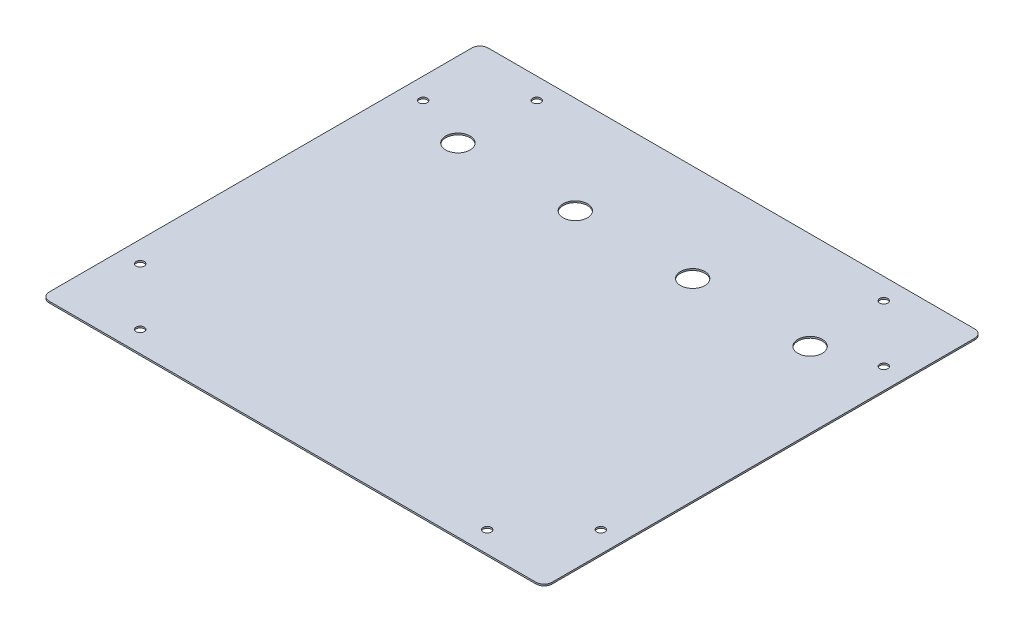
ISO-10303-21;
HEADER;
FILE_DESCRIPTION(('STEP AP214'),'2;1');
FILE_NAME('part.step','',(''),(''),'','','');
FILE_SCHEMA(('AUTOMOTIVE_DESIGN { 1 0 10303 214 1 1 1 1 }'));
ENDSEC;
DATA;
#1=APPLICATION_CONTEXT('core data for automotive mechanical design processes');
#2=APPLICATION_PROTOCOL_DEFINITION('international standard','automotive_design',2000,#1);
#3=PRODUCT_CONTEXT('',#1,'mechanical');
#4=PRODUCT('Part','Part','',(#3));
#5=PRODUCT_RELATED_PRODUCT_CATEGORY('part','',(#4));
#6=PRODUCT_DEFINITION_FORMATION('','',#4);
#7=PRODUCT_DEFINITION_CONTEXT('part definition',#1,'design');
#8=PRODUCT_DEFINITION('design','',#6,#7);
#9=PRODUCT_DEFINITION_SHAPE('','',#8);
#10=(LENGTH_UNIT() NAMED_UNIT(*) SI_UNIT(.MILLI.,.METRE.));
#11=(NAMED_UNIT(*) PLANE_ANGLE_UNIT() SI_UNIT($,.RADIAN.));
#12=(NAMED_UNIT(*) SI_UNIT($,.STERADIAN.) SOLID_ANGLE_UNIT());
#13=UNCERTAINTY_MEASURE_WITH_UNIT(LENGTH_MEASURE(1.E-05),#10,'distance_accuracy_value','');
#14=(GEOMETRIC_REPRESENTATION_CONTEXT(3) GLOBAL_UNCERTAINTY_ASSIGNED_CONTEXT((#13)) GLOBAL_UNIT_ASSIGNED_CONTEXT((#10,
#11,#12)) REPRESENTATION_CONTEXT('',''));
#15=CARTESIAN_POINT('',(0.,0.,0.));
#16=DIRECTION('',(0.,0.,1.));
#17=DIRECTION('',(1.,0.,0.));
#18=AXIS2_PLACEMENT_3D('',#15,#16,#17);
#19=CARTESIAN_POINT('',(-154.9,-1.,135.17));
#20=DIRECTION('',(-1.,0.,0.));
#21=DIRECTION('',(0.,0.,1.));
#22=AXIS2_PLACEMENT_3D('',#19,#20,#21);
#23=PLANE('',#22);
#24=DIRECTION('',(0.,0.,1.));
#25=VECTOR('',#24,1.);
#26=CARTESIAN_POINT('',(-154.9,-1.,135.17));
#27=LINE('',#26,#25);
#28=CARTESIAN_POINT('',(-154.9,-1.,-130.17));
#29=VERTEX_POINT('',#28);
#30=CARTESIAN_POINT('',(-154.9,-1.,130.17));
#31=VERTEX_POINT('',#30);
#32=EDGE_CURVE('E227',#29,#31,#27,.T.);
#33=ORIENTED_EDGE('',*,*,#32,.T.);
#34=DIRECTION('',(0.,1.,0.));
#35=VECTOR('',#34,1.);
#36=CARTESIAN_POINT('',(-154.9,-1.,130.17));
#37=LINE('',#36,#35);
#38=CARTESIAN_POINT('',(-154.9,0.,130.17));
#39=VERTEX_POINT('',#38);
#40=EDGE_CURVE('E125',#31,#39,#37,.T.);
#41=ORIENTED_EDGE('',*,*,#40,.T.);
#42=DIRECTION('',(0.,0.,1.));
#43=VECTOR('',#42,1.);
#44=CARTESIAN_POINT('',(-154.9,0.,135.17));
#45=LINE('',#44,#43);
#46=CARTESIAN_POINT('',(-154.9,0.,-130.17));
#47=VERTEX_POINT('',#46);
#48=EDGE_CURVE('E109',#47,#39,#45,.T.);
#49=ORIENTED_EDGE('',*,*,#48,.F.);
#50=DIRECTION('',(0.,1.,0.));
#51=VECTOR('',#50,1.);
#52=CARTESIAN_POINT('',(-154.9,-1.,-130.17));
#53=LINE('',#52,#51);
#54=EDGE_CURVE('E122',#47,#29,#53,.F.);
#55=ORIENTED_EDGE('',*,*,#54,.T.);
#56=EDGE_LOOP('',(#33,#41,#49,#55));
#57=FACE_BOUND('',#56,.T.);
#58=ADVANCED_FACE('F38',(#57),#23,.T.);
#59=CARTESIAN_POINT('',(154.9,-1.,-135.17));
#60=DIRECTION('',(0.,0.,-1.));
#61=DIRECTION('',(-1.,0.,0.));
#62=AXIS2_PLACEMENT_3D('',#59,#60,#61);
#63=PLANE('',#62);
#64=DIRECTION('',(-1.,0.,0.));
#65=VECTOR('',#64,1.);
#66=CARTESIAN_POINT('',(154.9,-1.,-135.17));
#67=LINE('',#66,#65);
#68=CARTESIAN_POINT('',(149.9,-1.,-135.17));
#69=VERTEX_POINT('',#68);
#70=CARTESIAN_POINT('',(-149.9,-1.,-135.17));
#71=VERTEX_POINT('',#70);
#72=EDGE_CURVE('E132',#69,#71,#67,.T.);
#73=ORIENTED_EDGE('',*,*,#72,.T.);
#74=DIRECTION('',(0.,1.,0.));
#75=VECTOR('',#74,1.);
#76=CARTESIAN_POINT('',(-149.9,-1.,-135.17));
#77=LINE('',#76,#75);
#78=CARTESIAN_POINT('',(-149.9,0.,-135.17));
#79=VERTEX_POINT('',#78);
#80=EDGE_CURVE('E158',#71,#79,#77,.T.);
#81=ORIENTED_EDGE('',*,*,#80,.T.);
#82=DIRECTION('',(-1.,0.,0.));
#83=VECTOR('',#82,1.);
#84=CARTESIAN_POINT('',(154.9,0.,-135.17));
#85=LINE('',#84,#83);
#86=CARTESIAN_POINT('',(149.9,0.,-135.17));
#87=VERTEX_POINT('',#86);
#88=EDGE_CURVE('E111',#87,#79,#85,.T.);
#89=ORIENTED_EDGE('',*,*,#88,.F.);
#90=DIRECTION('',(0.,1.,0.));
#91=VECTOR('',#90,1.);
#92=CARTESIAN_POINT('',(149.9,-1.,-135.17));
#93=LINE('',#92,#91);
#94=EDGE_CURVE('E156',#87,#69,#93,.F.);
#95=ORIENTED_EDGE('',*,*,#94,.T.);
#96=EDGE_LOOP('',(#73,#81,#89,#95));
#97=FACE_BOUND('',#96,.T.);
#98=ADVANCED_FACE('F251',(#97),#63,.T.);
#99=CARTESIAN_POINT('',(154.9,-1.,135.17));
#100=DIRECTION('',(1.,0.,0.));
#101=DIRECTION('',(0.,0.,-1.));
#102=AXIS2_PLACEMENT_3D('',#99,#100,#101);
#103=PLANE('',#102);
#104=DIRECTION('',(0.,0.,-1.));
#105=VECTOR('',#104,1.);
#106=CARTESIAN_POINT('',(154.9,-1.,135.17));
#107=LINE('',#106,#105);
#108=CARTESIAN_POINT('',(154.9,-1.,130.17));
#109=VERTEX_POINT('',#108);
#110=CARTESIAN_POINT('',(154.9,-1.,-130.17));
#111=VERTEX_POINT('',#110);
#112=EDGE_CURVE('E137',#109,#111,#107,.T.);
#113=ORIENTED_EDGE('',*,*,#112,.T.);
#114=DIRECTION('',(0.,1.,0.));
#115=VECTOR('',#114,1.);
#116=CARTESIAN_POINT('',(154.9,-1.,-130.17));
#117=LINE('',#116,#115);
#118=CARTESIAN_POINT('',(154.9,0.,-130.17));
#119=VERTEX_POINT('',#118);
#120=EDGE_CURVE('E11',#111,#119,#117,.T.);
#121=ORIENTED_EDGE('',*,*,#120,.T.);
#122=DIRECTION('',(0.,0.,-1.));
#123=VECTOR('',#122,1.);
#124=CARTESIAN_POINT('',(154.9,0.,135.17));
#125=LINE('',#124,#123);
#126=CARTESIAN_POINT('',(154.9,0.,130.17));
#127=VERTEX_POINT('',#126);
#128=EDGE_CURVE('E234',#127,#119,#125,.T.);
#129=ORIENTED_EDGE('',*,*,#128,.F.);
#130=DIRECTION('',(0.,1.,0.));
#131=VECTOR('',#130,1.);
#132=CARTESIAN_POINT('',(154.9,-1.,130.17));
#133=LINE('',#132,#131);
#134=EDGE_CURVE('E47',#127,#109,#133,.F.);
#135=ORIENTED_EDGE('',*,*,#134,.T.);
#136=EDGE_LOOP('',(#113,#121,#129,#135));
#137=FACE_BOUND('',#136,.T.);
#138=ADVANCED_FACE('F236',(#137),#103,.T.);
#139=CARTESIAN_POINT('',(154.9,-1.,135.17));
#140=DIRECTION('',(0.,0.,1.));
#141=DIRECTION('',(1.,0.,0.));
#142=AXIS2_PLACEMENT_3D('',#139,#140,#141);
#143=PLANE('',#142);
#144=DIRECTION('',(1.,0.,0.));
#145=VECTOR('',#144,1.);
#146=CARTESIAN_POINT('',(154.9,0.,135.17));
#147=LINE('',#146,#145);
#148=CARTESIAN_POINT('',(-149.9,0.,135.17));
#149=VERTEX_POINT('',#148);
#150=CARTESIAN_POINT('',(149.9,0.,135.17));
#151=VERTEX_POINT('',#150);
#152=EDGE_CURVE('E126',#149,#151,#147,.T.);
#153=ORIENTED_EDGE('',*,*,#152,.F.);
#154=DIRECTION('',(0.,1.,0.));
#155=VECTOR('',#154,1.);
#156=CARTESIAN_POINT('',(-149.9,-1.,135.17));
#157=LINE('',#156,#155);
#158=CARTESIAN_POINT('',(-149.9,-1.,135.17));
#159=VERTEX_POINT('',#158);
#160=EDGE_CURVE('E148',#149,#159,#157,.F.);
#161=ORIENTED_EDGE('',*,*,#160,.T.);
#162=DIRECTION('',(1.,0.,0.));
#163=VECTOR('',#162,1.);
#164=CARTESIAN_POINT('',(154.9,-1.,135.17));
#165=LINE('',#164,#163);
#166=CARTESIAN_POINT('',(149.9,-1.,135.17));
#167=VERTEX_POINT('',#166);
#168=EDGE_CURVE('E229',#159,#167,#165,.T.);
#169=ORIENTED_EDGE('',*,*,#168,.T.);
#170=DIRECTION('',(0.,1.,0.));
#171=VECTOR('',#170,1.);
#172=CARTESIAN_POINT('',(149.9,-1.,135.17));
#173=LINE('',#172,#171);
#174=EDGE_CURVE('E145',#167,#151,#173,.T.);
#175=ORIENTED_EDGE('',*,*,#174,.T.);
#176=EDGE_LOOP('',(#153,#161,#169,#175));
#177=FACE_BOUND('',#176,.T.);
#178=ADVANCED_FACE('F246',(#177),#143,.T.);
#179=CARTESIAN_POINT('',(0.,-1.,0.));
#180=DIRECTION('',(0.,1.,0.));
#181=DIRECTION('',(0.,0.,1.));
#182=AXIS2_PLACEMENT_3D('',#179,#180,#181);
#183=PLANE('',#182);
#184=CARTESIAN_POINT('',(-108.5,-1.,-75.17));
#185=DIRECTION('',(0.,-1.,0.));
#186=DIRECTION('',(0.,0.,-1.));
#187=AXIS2_PLACEMENT_3D('',#184,#185,#186);
#188=CIRCLE('',#187,7.5);
#189=CARTESIAN_POINT('',(-108.5,-1.,-82.67));
#190=VERTEX_POINT('',#189);
#191=EDGE_CURVE('E189',#190,#190,#188,.T.);
#192=ORIENTED_EDGE('',*,*,#191,.F.);
#193=EDGE_LOOP('',(#192));
#194=FACE_BOUND('',#193,.T.);
#195=CARTESIAN_POINT('',(-36.1666666666664,-1.,-75.17));
#196=DIRECTION('',(0.,-1.,0.));
#197=DIRECTION('',(0.,0.,-1.));
#198=AXIS2_PLACEMENT_3D('',#195,#196,#197);
#199=CIRCLE('',#198,7.5);
#200=CARTESIAN_POINT('',(-36.1666666666664,-1.,-82.67));
#201=VERTEX_POINT('',#200);
#202=EDGE_CURVE('E470',#201,#201,#199,.T.);
#203=ORIENTED_EDGE('',*,*,#202,.F.);
#204=EDGE_LOOP('',(#203));
#205=FACE_BOUND('',#204,.T.);
#206=CARTESIAN_POINT('',(36.1666666666669,-1.,-75.17));
#207=DIRECTION('',(0.,-1.,0.));
#208=DIRECTION('',(0.,0.,-1.));
#209=AXIS2_PLACEMENT_3D('',#206,#207,#208);
#210=CIRCLE('',#209,7.5);
#211=CARTESIAN_POINT('',(36.1666666666669,-1.,-82.67));
#212=VERTEX_POINT('',#211);
#213=EDGE_CURVE('E473',#212,#212,#210,.T.);
#214=ORIENTED_EDGE('',*,*,#213,.F.);
#215=EDGE_LOOP('',(#214));
#216=FACE_BOUND('',#215,.T.);
#217=CARTESIAN_POINT('',(108.5,-1.,-75.17));
#218=DIRECTION('',(0.,-1.,0.));
#219=DIRECTION('',(0.,0.,-1.));
#220=AXIS2_PLACEMENT_3D('',#217,#218,#219);
#221=CIRCLE('',#220,7.50000000000001);
#222=CARTESIAN_POINT('',(108.5,-1.,-82.67));
#223=VERTEX_POINT('',#222);
#224=EDGE_CURVE('E209',#223,#223,#221,.T.);
#225=ORIENTED_EDGE('',*,*,#224,.F.);
#226=EDGE_LOOP('',(#225));
#227=FACE_BOUND('',#226,.T.);
#228=CARTESIAN_POINT('',(141.9,-1.,-87.1694858176282));
#229=DIRECTION('',(0.,-1.,0.));
#230=DIRECTION('',(0.,0.,-1.));
#231=AXIS2_PLACEMENT_3D('',#228,#229,#230);
#232=CIRCLE('',#231,2.5);
#233=CARTESIAN_POINT('',(141.9,-1.,-89.6694858176282));
#234=VERTEX_POINT('',#233);
#235=EDGE_CURVE('E212',#234,#234,#232,.T.);
#236=ORIENTED_EDGE('',*,*,#235,.F.);
#237=EDGE_LOOP('',(#236));
#238=FACE_BOUND('',#237,.T.);
#239=CARTESIAN_POINT('',(106.9,-1.,122.169485817628));
#240=DIRECTION('',(0.,-1.,0.));
#241=DIRECTION('',(0.,0.,1.));
#242=AXIS2_PLACEMENT_3D('',#239,#240,#241);
#243=CIRCLE('',#242,2.5);
#244=CARTESIAN_POINT('',(106.9,-1.,124.669485817628));
#245=VERTEX_POINT('',#244);
#246=EDGE_CURVE('E214',#245,#245,#243,.T.);
#247=ORIENTED_EDGE('',*,*,#246,.F.);
#248=EDGE_LOOP('',(#247));
#249=FACE_BOUND('',#248,.T.);
#250=CARTESIAN_POINT('',(141.9,-1.,87.1694858176282));
#251=DIRECTION('',(0.,-1.,0.));
#252=DIRECTION('',(0.,0.,1.));
#253=AXIS2_PLACEMENT_3D('',#250,#251,#252);
#254=CIRCLE('',#253,2.5);
#255=CARTESIAN_POINT('',(141.9,-1.,89.6694858176282));
#256=VERTEX_POINT('',#255);
#257=EDGE_CURVE('E217',#256,#256,#254,.T.);
#258=ORIENTED_EDGE('',*,*,#257,.F.);
#259=EDGE_LOOP('',(#258));
#260=FACE_BOUND('',#259,.T.);
#261=CARTESIAN_POINT('',(-106.9,-1.,122.169485817628));
#262=DIRECTION('',(0.,-1.,0.));
#263=DIRECTION('',(0.,0.,-1.));
#264=AXIS2_PLACEMENT_3D('',#261,#262,#263);
#265=CIRCLE('',#264,2.5);
#266=CARTESIAN_POINT('',(-106.9,-1.,119.669485817628));
#267=VERTEX_POINT('',#266);
#268=EDGE_CURVE('E220',#267,#267,#265,.T.);
#269=ORIENTED_EDGE('',*,*,#268,.F.);
#270=EDGE_LOOP('',(#269));
#271=FACE_BOUND('',#270,.T.);
#272=CARTESIAN_POINT('',(-106.9,-1.,-122.169485817628));
#273=DIRECTION('',(0.,-1.,0.));
#274=DIRECTION('',(0.,0.,1.));
#275=AXIS2_PLACEMENT_3D('',#272,#273,#274);
#276=CIRCLE('',#275,2.5);
#277=CARTESIAN_POINT('',(-106.9,-1.,-119.669485817628));
#278=VERTEX_POINT('',#277);
#279=EDGE_CURVE('E196',#278,#278,#276,.T.);
#280=ORIENTED_EDGE('',*,*,#279,.F.);
#281=EDGE_LOOP('',(#280));
#282=FACE_BOUND('',#281,.T.);
#283=CARTESIAN_POINT('',(-141.9,-1.,-87.1694858176282));
#284=DIRECTION('',(0.,-1.,0.));
#285=DIRECTION('',(0.,0.,1.));
#286=AXIS2_PLACEMENT_3D('',#283,#284,#285);
#287=CIRCLE('',#286,2.5);
#288=CARTESIAN_POINT('',(-141.9,-1.,-84.6694858176282));
#289=VERTEX_POINT('',#288);
#290=EDGE_CURVE('E200',#289,#289,#287,.T.);
#291=ORIENTED_EDGE('',*,*,#290,.F.);
#292=EDGE_LOOP('',(#291));
#293=FACE_BOUND('',#292,.T.);
#294=CARTESIAN_POINT('',(106.9,-1.,-122.169485817628));
#295=DIRECTION('',(0.,-1.,0.));
#296=DIRECTION('',(0.,0.,-1.));
#297=AXIS2_PLACEMENT_3D('',#294,#295,#296);
#298=CIRCLE('',#297,2.5);
#299=CARTESIAN_POINT('',(106.9,-1.,-124.669485817628));
#300=VERTEX_POINT('',#299);
#301=EDGE_CURVE('E205',#300,#300,#298,.T.);
#302=ORIENTED_EDGE('',*,*,#301,.F.);
#303=EDGE_LOOP('',(#302));
#304=FACE_BOUND('',#303,.T.);
#305=CARTESIAN_POINT('',(-141.9,-1.,87.1694858176282));
#306=DIRECTION('',(0.,-1.,0.));
#307=DIRECTION('',(0.,0.,-1.));
#308=AXIS2_PLACEMENT_3D('',#305,#306,#307);
#309=CIRCLE('',#308,2.5);
#310=CARTESIAN_POINT('',(-141.9,-1.,84.6694858176282));
#311=VERTEX_POINT('',#310);
#312=EDGE_CURVE('E165',#311,#311,#309,.T.);
#313=ORIENTED_EDGE('',*,*,#312,.F.);
#314=EDGE_LOOP('',(#313));
#315=FACE_BOUND('',#314,.T.);
#316=ORIENTED_EDGE('',*,*,#168,.F.);
#317=CARTESIAN_POINT('',(-149.9,-1.,130.17));
#318=DIRECTION('',(0.,1.,0.));
#319=DIRECTION('',(0.,0.,1.));
#320=AXIS2_PLACEMENT_3D('',#317,#318,#319);
#321=CIRCLE('',#320,5.);
#322=EDGE_CURVE('E154',#159,#31,#321,.F.);
#323=ORIENTED_EDGE('',*,*,#322,.T.);
#324=ORIENTED_EDGE('',*,*,#32,.F.);
#325=CARTESIAN_POINT('',(-149.9,-1.,-130.17));
#326=DIRECTION('',(0.,1.,0.));
#327=DIRECTION('',(0.,0.,1.));
#328=AXIS2_PLACEMENT_3D('',#325,#326,#327);
#329=CIRCLE('',#328,5.);
#330=EDGE_CURVE('E131',#29,#71,#329,.F.);
#331=ORIENTED_EDGE('',*,*,#330,.T.);
#332=ORIENTED_EDGE('',*,*,#72,.F.);
#333=CARTESIAN_POINT('',(149.9,-1.,-130.17));
#334=DIRECTION('',(0.,1.,0.));
#335=DIRECTION('',(0.,0.,1.));
#336=AXIS2_PLACEMENT_3D('',#333,#334,#335);
#337=CIRCLE('',#336,5.);
#338=EDGE_CURVE('E55',#69,#111,#337,.F.);
#339=ORIENTED_EDGE('',*,*,#338,.T.);
#340=ORIENTED_EDGE('',*,*,#112,.F.);
#341=CARTESIAN_POINT('',(149.9,-1.,130.17));
#342=DIRECTION('',(0.,1.,0.));
#343=DIRECTION('',(0.,0.,1.));
#344=AXIS2_PLACEMENT_3D('',#341,#342,#343);
#345=CIRCLE('',#344,5.);
#346=EDGE_CURVE('E150',#109,#167,#345,.F.);
#347=ORIENTED_EDGE('',*,*,#346,.T.);
#348=EDGE_LOOP('',(#316,#323,#324,#331,#332,#339,#340,#347));
#349=FACE_BOUND('',#348,.T.);
#350=ADVANCED_FACE('F242',(#194,#205,#216,#227,#238,#249,#260,#271,#282,#293,#304,#315,#349),
#183,.F.);
#351=CARTESIAN_POINT('',(0.,0.,0.));
#352=DIRECTION('',(0.,1.,0.));
#353=DIRECTION('',(0.,0.,1.));
#354=AXIS2_PLACEMENT_3D('',#351,#352,#353);
#355=PLANE('',#354);
#356=CARTESIAN_POINT('',(-108.5,0.,-75.17));
#357=DIRECTION('',(0.,1.,0.));
#358=DIRECTION('',(0.,0.,1.));
#359=AXIS2_PLACEMENT_3D('',#356,#357,#358);
#360=CIRCLE('',#359,7.5);
#361=CARTESIAN_POINT('',(-108.5,0.,-67.67));
#362=VERTEX_POINT('',#361);
#363=EDGE_CURVE('E42',#362,#362,#360,.T.);
#364=ORIENTED_EDGE('',*,*,#363,.F.);
#365=EDGE_LOOP('',(#364));
#366=FACE_BOUND('',#365,.T.);
#367=CARTESIAN_POINT('',(-36.1666666666664,0.,-75.17));
#368=DIRECTION('',(0.,1.,0.));
#369=DIRECTION('',(0.,0.,1.));
#370=AXIS2_PLACEMENT_3D('',#367,#368,#369);
#371=CIRCLE('',#370,7.5);
#372=CARTESIAN_POINT('',(-36.1666666666664,0.,-67.67));
#373=VERTEX_POINT('',#372);
#374=EDGE_CURVE('E191',#373,#373,#371,.T.);
#375=ORIENTED_EDGE('',*,*,#374,.F.);
#376=EDGE_LOOP('',(#375));
#377=FACE_BOUND('',#376,.T.);
#378=CARTESIAN_POINT('',(36.1666666666669,0.,-75.17));
#379=DIRECTION('',(0.,1.,0.));
#380=DIRECTION('',(0.,0.,1.));
#381=AXIS2_PLACEMENT_3D('',#378,#379,#380);
#382=CIRCLE('',#381,7.5);
#383=CARTESIAN_POINT('',(36.1666666666669,0.,-67.67));
#384=VERTEX_POINT('',#383);
#385=EDGE_CURVE('E188',#384,#384,#382,.T.);
#386=ORIENTED_EDGE('',*,*,#385,.F.);
#387=EDGE_LOOP('',(#386));
#388=FACE_BOUND('',#387,.T.);
#389=CARTESIAN_POINT('',(108.5,0.,-75.17));
#390=DIRECTION('',(0.,1.,0.));
#391=DIRECTION('',(0.,0.,1.));
#392=AXIS2_PLACEMENT_3D('',#389,#390,#391);
#393=CIRCLE('',#392,7.50000000000001);
#394=CARTESIAN_POINT('',(108.5,0.,-67.6699999999999));
#395=VERTEX_POINT('',#394);
#396=EDGE_CURVE('E185',#395,#395,#393,.T.);
#397=ORIENTED_EDGE('',*,*,#396,.F.);
#398=EDGE_LOOP('',(#397));
#399=FACE_BOUND('',#398,.T.);
#400=CARTESIAN_POINT('',(141.9,0.,-87.1694858176282));
#401=DIRECTION('',(0.,1.,0.));
#402=DIRECTION('',(0.,0.,1.));
#403=AXIS2_PLACEMENT_3D('',#400,#401,#402);
#404=CIRCLE('',#403,2.5);
#405=CARTESIAN_POINT('',(141.9,0.,-84.6694858176282));
#406=VERTEX_POINT('',#405);
#407=EDGE_CURVE('E127',#406,#406,#404,.T.);
#408=ORIENTED_EDGE('',*,*,#407,.F.);
#409=EDGE_LOOP('',(#408));
#410=FACE_BOUND('',#409,.T.);
#411=CARTESIAN_POINT('',(106.9,0.,122.169485817628));
#412=DIRECTION('',(0.,1.,0.));
#413=DIRECTION('',(0.,0.,1.));
#414=AXIS2_PLACEMENT_3D('',#411,#412,#413);
#415=CIRCLE('',#414,2.5);
#416=CARTESIAN_POINT('',(106.9,0.,124.669485817628));
#417=VERTEX_POINT('',#416);
#418=EDGE_CURVE('E180',#417,#417,#415,.T.);
#419=ORIENTED_EDGE('',*,*,#418,.F.);
#420=EDGE_LOOP('',(#419));
#421=FACE_BOUND('',#420,.T.);
#422=CARTESIAN_POINT('',(141.9,0.,87.1694858176282));
#423=DIRECTION('',(0.,1.,0.));
#424=DIRECTION('',(0.,0.,1.));
#425=AXIS2_PLACEMENT_3D('',#422,#423,#424);
#426=CIRCLE('',#425,2.5);
#427=CARTESIAN_POINT('',(141.9,0.,89.6694858176282));
#428=VERTEX_POINT('',#427);
#429=EDGE_CURVE('E177',#428,#428,#426,.T.);
#430=ORIENTED_EDGE('',*,*,#429,.F.);
#431=EDGE_LOOP('',(#430));
#432=FACE_BOUND('',#431,.T.);
#433=CARTESIAN_POINT('',(-106.9,0.,122.169485817628));
#434=DIRECTION('',(0.,1.,0.));
#435=DIRECTION('',(0.,0.,1.));
#436=AXIS2_PLACEMENT_3D('',#433,#434,#435);
#437=CIRCLE('',#436,2.5);
#438=CARTESIAN_POINT('',(-106.9,0.,124.669485817628));
#439=VERTEX_POINT('',#438);
#440=EDGE_CURVE('E174',#439,#439,#437,.T.);
#441=ORIENTED_EDGE('',*,*,#440,.F.);
#442=EDGE_LOOP('',(#441));
#443=FACE_BOUND('',#442,.T.);
#444=CARTESIAN_POINT('',(-106.9,0.,-122.169485817628));
#445=DIRECTION('',(0.,1.,0.));
#446=DIRECTION('',(0.,0.,1.));
#447=AXIS2_PLACEMENT_3D('',#444,#445,#446);
#448=CIRCLE('',#447,2.5);
#449=CARTESIAN_POINT('',(-106.9,0.,-119.669485817628));
#450=VERTEX_POINT('',#449);
#451=EDGE_CURVE('E171',#450,#450,#448,.T.);
#452=ORIENTED_EDGE('',*,*,#451,.F.);
#453=EDGE_LOOP('',(#452));
#454=FACE_BOUND('',#453,.T.);
#455=CARTESIAN_POINT('',(-141.9,0.,-87.1694858176282));
#456=DIRECTION('',(0.,1.,0.));
#457=DIRECTION('',(0.,0.,1.));
#458=AXIS2_PLACEMENT_3D('',#455,#456,#457);
#459=CIRCLE('',#458,2.5);
#460=CARTESIAN_POINT('',(-141.9,0.,-84.6694858176282));
#461=VERTEX_POINT('',#460);
#462=EDGE_CURVE('E168',#461,#461,#459,.T.);
#463=ORIENTED_EDGE('',*,*,#462,.F.);
#464=EDGE_LOOP('',(#463));
#465=FACE_BOUND('',#464,.T.);
#466=CARTESIAN_POINT('',(106.9,0.,-122.169485817628));
#467=DIRECTION('',(0.,1.,0.));
#468=DIRECTION('',(0.,0.,1.));
#469=AXIS2_PLACEMENT_3D('',#466,#467,#468);
#470=CIRCLE('',#469,2.5);
#471=CARTESIAN_POINT('',(106.9,0.,-119.669485817628));
#472=VERTEX_POINT('',#471);
#473=EDGE_CURVE('E164',#472,#472,#470,.T.);
#474=ORIENTED_EDGE('',*,*,#473,.F.);
#475=EDGE_LOOP('',(#474));
#476=FACE_BOUND('',#475,.T.);
#477=CARTESIAN_POINT('',(-141.9,0.,87.1694858176282));
#478=DIRECTION('',(0.,1.,0.));
#479=DIRECTION('',(0.,0.,1.));
#480=AXIS2_PLACEMENT_3D('',#477,#478,#479);
#481=CIRCLE('',#480,2.5);
#482=CARTESIAN_POINT('',(-141.9,0.,89.6694858176282));
#483=VERTEX_POINT('',#482);
#484=EDGE_CURVE('E161',#483,#483,#481,.T.);
#485=ORIENTED_EDGE('',*,*,#484,.F.);
#486=EDGE_LOOP('',(#485));
#487=FACE_BOUND('',#486,.T.);
#488=ORIENTED_EDGE('',*,*,#48,.T.);
#489=CARTESIAN_POINT('',(-149.9,0.,130.17));
#490=DIRECTION('',(0.,1.,0.));
#491=DIRECTION('',(0.,0.,1.));
#492=AXIS2_PLACEMENT_3D('',#489,#490,#491);
#493=CIRCLE('',#492,5.);
#494=EDGE_CURVE('E116',#39,#149,#493,.T.);
#495=ORIENTED_EDGE('',*,*,#494,.T.);
#496=ORIENTED_EDGE('',*,*,#152,.T.);
#497=CARTESIAN_POINT('',(149.9,0.,130.17));
#498=DIRECTION('',(0.,1.,0.));
#499=DIRECTION('',(0.,0.,1.));
#500=AXIS2_PLACEMENT_3D('',#497,#498,#499);
#501=CIRCLE('',#500,5.);
#502=EDGE_CURVE('E134',#151,#127,#501,.T.);
#503=ORIENTED_EDGE('',*,*,#502,.T.);
#504=ORIENTED_EDGE('',*,*,#128,.T.);
#505=CARTESIAN_POINT('',(149.9,0.,-130.17));
#506=DIRECTION('',(0.,1.,0.));
#507=DIRECTION('',(0.,0.,1.));
#508=AXIS2_PLACEMENT_3D('',#505,#506,#507);
#509=CIRCLE('',#508,5.);
#510=EDGE_CURVE('E117',#119,#87,#509,.T.);
#511=ORIENTED_EDGE('',*,*,#510,.T.);
#512=ORIENTED_EDGE('',*,*,#88,.T.);
#513=CARTESIAN_POINT('',(-149.9,0.,-130.17));
#514=DIRECTION('',(0.,1.,0.));
#515=DIRECTION('',(0.,0.,1.));
#516=AXIS2_PLACEMENT_3D('',#513,#514,#515);
#517=CIRCLE('',#516,5.);
#518=EDGE_CURVE('E106',#79,#47,#517,.T.);
#519=ORIENTED_EDGE('',*,*,#518,.T.);
#520=EDGE_LOOP('',(#488,#495,#496,#503,#504,#511,#512,#519));
#521=FACE_BOUND('',#520,.T.);
#522=ADVANCED_FACE('F108',(#366,#377,#388,#399,#410,#421,#432,#443,#454,#465,#476,#487,#521),
#355,.T.);
#523=CARTESIAN_POINT('',(-149.9,-1.,130.17));
#524=DIRECTION('',(0.,1.,0.));
#525=DIRECTION('',(0.,0.,1.));
#526=AXIS2_PLACEMENT_3D('',#523,#524,#525);
#527=CYLINDRICAL_SURFACE('',#526,5.);
#528=ORIENTED_EDGE('',*,*,#322,.F.);
#529=ORIENTED_EDGE('',*,*,#160,.F.);
#530=ORIENTED_EDGE('',*,*,#494,.F.);
#531=ORIENTED_EDGE('',*,*,#40,.F.);
#532=EDGE_LOOP('',(#528,#529,#530,#531));
#533=FACE_BOUND('',#532,.T.);
#534=ADVANCED_FACE('F249',(#533),#527,.T.);
#535=CARTESIAN_POINT('',(-149.9,-1.,-130.17));
#536=DIRECTION('',(0.,1.,0.));
#537=DIRECTION('',(0.,0.,1.));
#538=AXIS2_PLACEMENT_3D('',#535,#536,#537);
#539=CYLINDRICAL_SURFACE('',#538,5.);
#540=ORIENTED_EDGE('',*,*,#330,.F.);
#541=ORIENTED_EDGE('',*,*,#54,.F.);
#542=ORIENTED_EDGE('',*,*,#518,.F.);
#543=ORIENTED_EDGE('',*,*,#80,.F.);
#544=EDGE_LOOP('',(#540,#541,#542,#543));
#545=FACE_BOUND('',#544,.T.);
#546=ADVANCED_FACE('F130',(#545),#539,.T.);
#547=CARTESIAN_POINT('',(149.9,-1.,-130.17));
#548=DIRECTION('',(0.,1.,0.));
#549=DIRECTION('',(0.,0.,1.));
#550=AXIS2_PLACEMENT_3D('',#547,#548,#549);
#551=CYLINDRICAL_SURFACE('',#550,5.);
#552=ORIENTED_EDGE('',*,*,#338,.F.);
#553=ORIENTED_EDGE('',*,*,#94,.F.);
#554=ORIENTED_EDGE('',*,*,#510,.F.);
#555=ORIENTED_EDGE('',*,*,#120,.F.);
#556=EDGE_LOOP('',(#552,#553,#554,#555));
#557=FACE_BOUND('',#556,.T.);
#558=ADVANCED_FACE('F254',(#557),#551,.T.);
#559=CARTESIAN_POINT('',(149.9,-1.,130.17));
#560=DIRECTION('',(0.,1.,0.));
#561=DIRECTION('',(0.,0.,1.));
#562=AXIS2_PLACEMENT_3D('',#559,#560,#561);
#563=CYLINDRICAL_SURFACE('',#562,5.);
#564=ORIENTED_EDGE('',*,*,#346,.F.);
#565=ORIENTED_EDGE('',*,*,#134,.F.);
#566=ORIENTED_EDGE('',*,*,#502,.F.);
#567=ORIENTED_EDGE('',*,*,#174,.F.);
#568=EDGE_LOOP('',(#564,#565,#566,#567));
#569=FACE_BOUND('',#568,.T.);
#570=ADVANCED_FACE('F40',(#569),#563,.T.);
#571=CARTESIAN_POINT('',(-141.9,9.,87.1694858176282));
#572=DIRECTION('',(0.,-1.,0.));
#573=DIRECTION('',(0.,0.,-1.));
#574=AXIS2_PLACEMENT_3D('',#571,#572,#573);
#575=CYLINDRICAL_SURFACE('',#574,2.5);
#576=ORIENTED_EDGE('',*,*,#484,.T.);
#577=EDGE_LOOP('',(#576));
#578=FACE_BOUND('',#577,.T.);
#579=ORIENTED_EDGE('',*,*,#312,.T.);
#580=EDGE_LOOP('',(#579));
#581=FACE_BOUND('',#580,.T.);
#582=ADVANCED_FACE('F260',(#578,#581),#575,.F.);
#583=CARTESIAN_POINT('',(106.9,9.,-122.169485817628));
#584=DIRECTION('',(0.,-1.,0.));
#585=DIRECTION('',(0.,0.,-1.));
#586=AXIS2_PLACEMENT_3D('',#583,#584,#585);
#587=CYLINDRICAL_SURFACE('',#586,2.5);
#588=ORIENTED_EDGE('',*,*,#473,.T.);
#589=EDGE_LOOP('',(#588));
#590=FACE_BOUND('',#589,.T.);
#591=ORIENTED_EDGE('',*,*,#301,.T.);
#592=EDGE_LOOP('',(#591));
#593=FACE_BOUND('',#592,.T.);
#594=ADVANCED_FACE('F320',(#590,#593),#587,.F.);
#595=CARTESIAN_POINT('',(-141.9,9.,-87.1694858176282));
#596=DIRECTION('',(0.,-1.,0.));
#597=DIRECTION('',(0.,0.,-1.));
#598=AXIS2_PLACEMENT_3D('',#595,#596,#597);
#599=CYLINDRICAL_SURFACE('',#598,2.5);
#600=ORIENTED_EDGE('',*,*,#462,.T.);
#601=EDGE_LOOP('',(#600));
#602=FACE_BOUND('',#601,.T.);
#603=ORIENTED_EDGE('',*,*,#290,.T.);
#604=EDGE_LOOP('',(#603));
#605=FACE_BOUND('',#604,.T.);
#606=ADVANCED_FACE('F330',(#602,#605),#599,.F.);
#607=CARTESIAN_POINT('',(-106.9,9.,-122.169485817628));
#608=DIRECTION('',(0.,-1.,0.));
#609=DIRECTION('',(0.,0.,-1.));
#610=AXIS2_PLACEMENT_3D('',#607,#608,#609);
#611=CYLINDRICAL_SURFACE('',#610,2.5);
#612=ORIENTED_EDGE('',*,*,#451,.T.);
#613=EDGE_LOOP('',(#612));
#614=FACE_BOUND('',#613,.T.);
#615=ORIENTED_EDGE('',*,*,#279,.T.);
#616=EDGE_LOOP('',(#615));
#617=FACE_BOUND('',#616,.T.);
#618=ADVANCED_FACE('F341',(#614,#617),#611,.F.);
#619=CARTESIAN_POINT('',(-106.9,9.,122.169485817628));
#620=DIRECTION('',(0.,-1.,0.));
#621=DIRECTION('',(0.,0.,-1.));
#622=AXIS2_PLACEMENT_3D('',#619,#620,#621);
#623=CYLINDRICAL_SURFACE('',#622,2.5);
#624=ORIENTED_EDGE('',*,*,#440,.T.);
#625=EDGE_LOOP('',(#624));
#626=FACE_BOUND('',#625,.T.);
#627=ORIENTED_EDGE('',*,*,#268,.T.);
#628=EDGE_LOOP('',(#627));
#629=FACE_BOUND('',#628,.T.);
#630=ADVANCED_FACE('F352',(#626,#629),#623,.F.);
#631=CARTESIAN_POINT('',(141.9,9.,87.1694858176282));
#632=DIRECTION('',(0.,-1.,0.));
#633=DIRECTION('',(0.,0.,-1.));
#634=AXIS2_PLACEMENT_3D('',#631,#632,#633);
#635=CYLINDRICAL_SURFACE('',#634,2.5);
#636=ORIENTED_EDGE('',*,*,#429,.T.);
#637=EDGE_LOOP('',(#636));
#638=FACE_BOUND('',#637,.T.);
#639=ORIENTED_EDGE('',*,*,#257,.T.);
#640=EDGE_LOOP('',(#639));
#641=FACE_BOUND('',#640,.T.);
#642=ADVANCED_FACE('F363',(#638,#641),#635,.F.);
#643=CARTESIAN_POINT('',(106.9,9.,122.169485817628));
#644=DIRECTION('',(0.,-1.,0.));
#645=DIRECTION('',(0.,0.,-1.));
#646=AXIS2_PLACEMENT_3D('',#643,#644,#645);
#647=CYLINDRICAL_SURFACE('',#646,2.5);
#648=ORIENTED_EDGE('',*,*,#418,.T.);
#649=EDGE_LOOP('',(#648));
#650=FACE_BOUND('',#649,.T.);
#651=ORIENTED_EDGE('',*,*,#246,.T.);
#652=EDGE_LOOP('',(#651));
#653=FACE_BOUND('',#652,.T.);
#654=ADVANCED_FACE('F374',(#650,#653),#647,.F.);
#655=CARTESIAN_POINT('',(141.9,9.,-87.1694858176282));
#656=DIRECTION('',(0.,-1.,0.));
#657=DIRECTION('',(0.,0.,-1.));
#658=AXIS2_PLACEMENT_3D('',#655,#656,#657);
#659=CYLINDRICAL_SURFACE('',#658,2.5);
#660=ORIENTED_EDGE('',*,*,#407,.T.);
#661=EDGE_LOOP('',(#660));
#662=FACE_BOUND('',#661,.T.);
#663=ORIENTED_EDGE('',*,*,#235,.T.);
#664=EDGE_LOOP('',(#663));
#665=FACE_BOUND('',#664,.T.);
#666=ADVANCED_FACE('F385',(#662,#665),#659,.F.);
#667=CARTESIAN_POINT('',(108.5,9.,-75.17));
#668=DIRECTION('',(0.,-1.,0.));
#669=DIRECTION('',(0.,0.,-1.));
#670=AXIS2_PLACEMENT_3D('',#667,#668,#669);
#671=CYLINDRICAL_SURFACE('',#670,7.50000000000001);
#672=ORIENTED_EDGE('',*,*,#396,.T.);
#673=EDGE_LOOP('',(#672));
#674=FACE_BOUND('',#673,.T.);
#675=ORIENTED_EDGE('',*,*,#224,.T.);
#676=EDGE_LOOP('',(#675));
#677=FACE_BOUND('',#676,.T.);
#678=ADVANCED_FACE('F395',(#674,#677),#671,.F.);
#679=CARTESIAN_POINT('',(36.1666666666669,9.,-75.17));
#680=DIRECTION('',(0.,-1.,0.));
#681=DIRECTION('',(0.,0.,-1.));
#682=AXIS2_PLACEMENT_3D('',#679,#680,#681);
#683=CYLINDRICAL_SURFACE('',#682,7.5);
#684=ORIENTED_EDGE('',*,*,#385,.T.);
#685=EDGE_LOOP('',(#684));
#686=FACE_BOUND('',#685,.T.);
#687=ORIENTED_EDGE('',*,*,#213,.T.);
#688=EDGE_LOOP('',(#687));
#689=FACE_BOUND('',#688,.T.);
#690=ADVANCED_FACE('F428',(#686,#689),#683,.F.);
#691=CARTESIAN_POINT('',(-36.1666666666664,9.,-75.17));
#692=DIRECTION('',(0.,-1.,0.));
#693=DIRECTION('',(0.,0.,-1.));
#694=AXIS2_PLACEMENT_3D('',#691,#692,#693);
#695=CYLINDRICAL_SURFACE('',#694,7.5);
#696=ORIENTED_EDGE('',*,*,#374,.T.);
#697=EDGE_LOOP('',(#696));
#698=FACE_BOUND('',#697,.T.);
#699=ORIENTED_EDGE('',*,*,#202,.T.);
#700=EDGE_LOOP('',(#699));
#701=FACE_BOUND('',#700,.T.);
#702=ADVANCED_FACE('F437',(#698,#701),#695,.F.);
#703=CARTESIAN_POINT('',(-108.5,9.,-75.17));
#704=DIRECTION('',(0.,-1.,0.));
#705=DIRECTION('',(0.,0.,-1.));
#706=AXIS2_PLACEMENT_3D('',#703,#704,#705);
#707=CYLINDRICAL_SURFACE('',#706,7.5);
#708=ORIENTED_EDGE('',*,*,#363,.T.);
#709=EDGE_LOOP('',(#708));
#710=FACE_BOUND('',#709,.T.);
#711=ORIENTED_EDGE('',*,*,#191,.T.);
#712=EDGE_LOOP('',(#711));
#713=FACE_BOUND('',#712,.T.);
#714=ADVANCED_FACE('F447',(#710,#713),#707,.F.);
#715=CLOSED_SHELL('',(#58,#98,#138,#178,#350,#522,#534,#546,#558,#570,#582,#594,#606,#618,#630,
#642,#654,#666,#678,#690,#702,#714));
#716=MANIFOLD_SOLID_BREP('B2',#715);
#717=ADVANCED_BREP_SHAPE_REPRESENTATION('',(#18,#716),#14);
#718=SHAPE_DEFINITION_REPRESENTATION(#9,#717);
ENDSEC;
END-ISO-10303-21;
